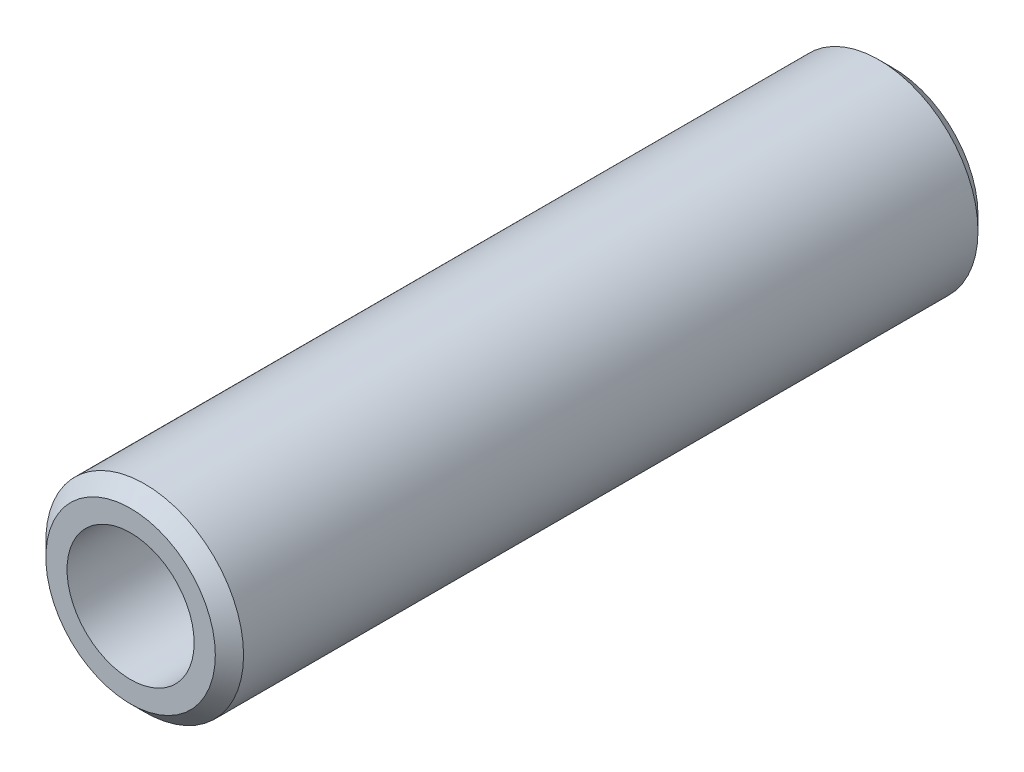
ISO-10303-21;
HEADER;
FILE_DESCRIPTION(('STEP AP214'),'2;1');
FILE_NAME('part.step','',(''),(''),'','','');
FILE_SCHEMA(('AUTOMOTIVE_DESIGN { 1 0 10303 214 1 1 1 1 }'));
ENDSEC;
DATA;
#1=APPLICATION_CONTEXT('core data for automotive mechanical design processes');
#2=APPLICATION_PROTOCOL_DEFINITION('international standard','automotive_design',2000,#1);
#3=PRODUCT_CONTEXT('',#1,'mechanical');
#4=PRODUCT('Part','Part','',(#3));
#5=PRODUCT_RELATED_PRODUCT_CATEGORY('part','',(#4));
#6=PRODUCT_DEFINITION_FORMATION('','',#4);
#7=PRODUCT_DEFINITION_CONTEXT('part definition',#1,'design');
#8=PRODUCT_DEFINITION('design','',#6,#7);
#9=PRODUCT_DEFINITION_SHAPE('','',#8);
#10=(LENGTH_UNIT() NAMED_UNIT(*) SI_UNIT(.MILLI.,.METRE.));
#11=(NAMED_UNIT(*) PLANE_ANGLE_UNIT() SI_UNIT($,.RADIAN.));
#12=(NAMED_UNIT(*) SI_UNIT($,.STERADIAN.) SOLID_ANGLE_UNIT());
#13=UNCERTAINTY_MEASURE_WITH_UNIT(LENGTH_MEASURE(1.E-05),#10,'distance_accuracy_value','');
#14=(GEOMETRIC_REPRESENTATION_CONTEXT(3) GLOBAL_UNCERTAINTY_ASSIGNED_CONTEXT((#13)) GLOBAL_UNIT_ASSIGNED_CONTEXT((#10,
#11,#12)) REPRESENTATION_CONTEXT('',''));
#15=CARTESIAN_POINT('',(0.,0.,0.));
#16=DIRECTION('',(0.,0.,1.));
#17=DIRECTION('',(1.,0.,0.));
#18=AXIS2_PLACEMENT_3D('',#15,#16,#17);
#19=CARTESIAN_POINT('',(0.,0.,13.5));
#20=DIRECTION('',(0.,0.,1.));
#21=DIRECTION('',(1.,0.,0.));
#22=AXIS2_PLACEMENT_3D('',#19,#20,#21);
#23=PLANE('',#22);
#24=CARTESIAN_POINT('',(0.,0.,13.5));
#25=DIRECTION('',(0.,0.,1.));
#26=DIRECTION('',(1.,0.,0.));
#27=AXIS2_PLACEMENT_3D('',#24,#25,#26);
#28=CIRCLE('',#27,3.);
#29=CARTESIAN_POINT('',(3.,0.,13.5));
#30=VERTEX_POINT('',#29);
#31=EDGE_CURVE('E10',#30,#30,#28,.T.);
#32=ORIENTED_EDGE('',*,*,#31,.T.);
#33=EDGE_LOOP('',(#32));
#34=FACE_BOUND('',#33,.T.);
#35=CARTESIAN_POINT('',(0.,0.,13.5));
#36=DIRECTION('',(0.,0.,1.));
#37=DIRECTION('',(1.,0.,0.));
#38=AXIS2_PLACEMENT_3D('',#35,#36,#37);
#39=CIRCLE('',#38,2.25);
#40=CARTESIAN_POINT('',(2.25,0.,13.5));
#41=VERTEX_POINT('',#40);
#42=EDGE_CURVE('E57',#41,#41,#39,.T.);
#43=ORIENTED_EDGE('',*,*,#42,.F.);
#44=EDGE_LOOP('',(#43));
#45=FACE_BOUND('',#44,.T.);
#46=ADVANCED_FACE('F36',(#34,#45),#23,.T.);
#47=CARTESIAN_POINT('',(0.,0.,-13.5));
#48=DIRECTION('',(0.,0.,1.));
#49=DIRECTION('',(1.,0.,0.));
#50=AXIS2_PLACEMENT_3D('',#47,#48,#49);
#51=PLANE('',#50);
#52=CARTESIAN_POINT('',(0.,0.,-13.5));
#53=DIRECTION('',(0.,0.,1.));
#54=DIRECTION('',(1.,0.,0.));
#55=AXIS2_PLACEMENT_3D('',#52,#53,#54);
#56=CIRCLE('',#55,3.);
#57=CARTESIAN_POINT('',(3.,0.,-13.5));
#58=VERTEX_POINT('',#57);
#59=EDGE_CURVE('E44',#58,#58,#56,.F.);
#60=ORIENTED_EDGE('',*,*,#59,.T.);
#61=EDGE_LOOP('',(#60));
#62=FACE_BOUND('',#61,.T.);
#63=CARTESIAN_POINT('',(0.,0.,-13.5));
#64=DIRECTION('',(0.,0.,1.));
#65=DIRECTION('',(1.,0.,0.));
#66=AXIS2_PLACEMENT_3D('',#63,#64,#65);
#67=CIRCLE('',#66,2.25);
#68=CARTESIAN_POINT('',(2.25,0.,-13.5));
#69=VERTEX_POINT('',#68);
#70=EDGE_CURVE('E58',#69,#69,#67,.T.);
#71=ORIENTED_EDGE('',*,*,#70,.T.);
#72=EDGE_LOOP('',(#71));
#73=FACE_BOUND('',#72,.T.);
#74=ADVANCED_FACE('F68',(#62,#73),#51,.F.);
#75=CARTESIAN_POINT('',(0.,0.,13.5));
#76=DIRECTION('',(0.,0.,-1.));
#77=DIRECTION('',(-1.,0.,0.));
#78=AXIS2_PLACEMENT_3D('',#75,#76,#77);
#79=CYLINDRICAL_SURFACE('',#78,3.5);
#80=CARTESIAN_POINT('',(0.,0.,-13.));
#81=DIRECTION('',(0.,0.,1.));
#82=DIRECTION('',(1.,0.,0.));
#83=AXIS2_PLACEMENT_3D('',#80,#81,#82);
#84=CIRCLE('',#83,3.5);
#85=CARTESIAN_POINT('',(3.5,0.,-13.));
#86=VERTEX_POINT('',#85);
#87=EDGE_CURVE('E48',#86,#86,#84,.T.);
#88=ORIENTED_EDGE('',*,*,#87,.T.);
#89=EDGE_LOOP('',(#88));
#90=FACE_BOUND('',#89,.T.);
#91=CARTESIAN_POINT('',(0.,0.,13.));
#92=DIRECTION('',(0.,0.,1.));
#93=DIRECTION('',(1.,0.,0.));
#94=AXIS2_PLACEMENT_3D('',#91,#92,#93);
#95=CIRCLE('',#94,3.5);
#96=CARTESIAN_POINT('',(3.5,0.,13.));
#97=VERTEX_POINT('',#96);
#98=EDGE_CURVE('E52',#97,#97,#95,.F.);
#99=ORIENTED_EDGE('',*,*,#98,.T.);
#100=EDGE_LOOP('',(#99));
#101=FACE_BOUND('',#100,.T.);
#102=ADVANCED_FACE('F73',(#90,#101),#79,.T.);
#103=CARTESIAN_POINT('',(0.,0.,13.5));
#104=DIRECTION('',(0.,0.,-1.));
#105=DIRECTION('',(-1.,0.,0.));
#106=AXIS2_PLACEMENT_3D('',#103,#104,#105);
#107=CYLINDRICAL_SURFACE('',#106,2.25);
#108=ORIENTED_EDGE('',*,*,#42,.T.);
#109=EDGE_LOOP('',(#108));
#110=FACE_BOUND('',#109,.T.);
#111=ORIENTED_EDGE('',*,*,#70,.F.);
#112=EDGE_LOOP('',(#111));
#113=FACE_BOUND('',#112,.T.);
#114=ADVANCED_FACE('F64',(#110,#113),#107,.F.);
#115=CARTESIAN_POINT('',(0.,0.,-13.));
#116=DIRECTION('',(0.,0.,1.));
#117=DIRECTION('',(1.,0.,0.));
#118=AXIS2_PLACEMENT_3D('',#115,#116,#117);
#119=CONICAL_SURFACE('',#118,3.5,0.785398163397449);
#120=ORIENTED_EDGE('',*,*,#59,.F.);
#121=EDGE_LOOP('',(#120));
#122=FACE_BOUND('',#121,.T.);
#123=ORIENTED_EDGE('',*,*,#87,.F.);
#124=EDGE_LOOP('',(#123));
#125=FACE_BOUND('',#124,.T.);
#126=ADVANCED_FACE('F80',(#122,#125),#119,.T.);
#127=CARTESIAN_POINT('',(0.,0.,13.5));
#128=DIRECTION('',(0.,0.,-1.));
#129=DIRECTION('',(-1.,0.,0.));
#130=AXIS2_PLACEMENT_3D('',#127,#128,#129);
#131=CONICAL_SURFACE('',#130,3.,0.785398163397444);
#132=ORIENTED_EDGE('',*,*,#98,.F.);
#133=EDGE_LOOP('',(#132));
#134=FACE_BOUND('',#133,.T.);
#135=ORIENTED_EDGE('',*,*,#31,.F.);
#136=EDGE_LOOP('',(#135));
#137=FACE_BOUND('',#136,.T.);
#138=ADVANCED_FACE('F39',(#134,#137),#131,.T.);
#139=CLOSED_SHELL('',(#46,#74,#102,#114,#126,#138));
#140=MANIFOLD_SOLID_BREP('B2',#139);
#141=ADVANCED_BREP_SHAPE_REPRESENTATION('',(#18,#140),#14);
#142=SHAPE_DEFINITION_REPRESENTATION(#9,#141);
ENDSEC;
END-ISO-10303-21;
